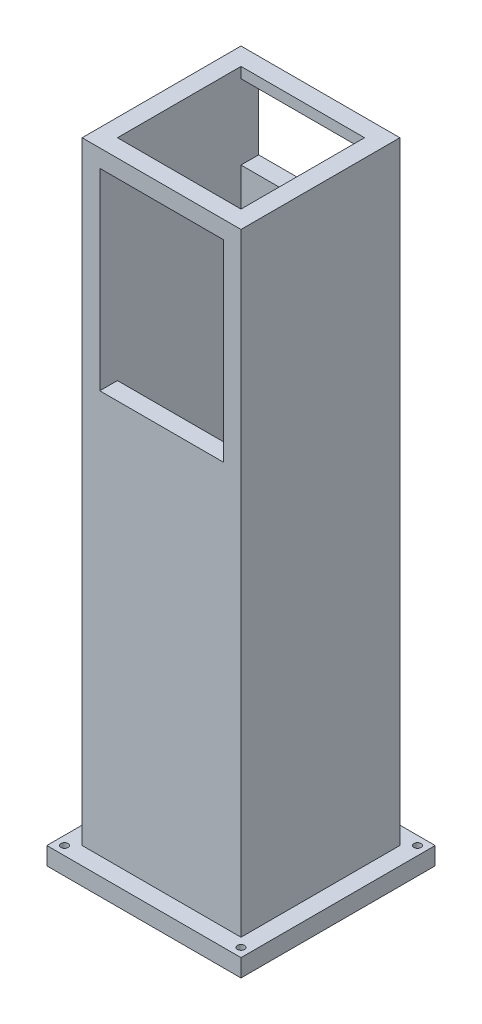
ISO-10303-21;
HEADER;
FILE_DESCRIPTION(('STEP AP214'),'2;1');
FILE_NAME('part.step','',(''),(''),'','','');
FILE_SCHEMA(('AUTOMOTIVE_DESIGN { 1 0 10303 214 1 1 1 1 }'));
ENDSEC;
DATA;
#1=APPLICATION_CONTEXT('core data for automotive mechanical design processes');
#2=APPLICATION_PROTOCOL_DEFINITION('international standard','automotive_design',2000,#1);
#3=PRODUCT_CONTEXT('',#1,'mechanical');
#4=PRODUCT('Part','Part','',(#3));
#5=PRODUCT_RELATED_PRODUCT_CATEGORY('part','',(#4));
#6=PRODUCT_DEFINITION_FORMATION('','',#4);
#7=PRODUCT_DEFINITION_CONTEXT('part definition',#1,'design');
#8=PRODUCT_DEFINITION('design','',#6,#7);
#9=PRODUCT_DEFINITION_SHAPE('','',#8);
#10=(LENGTH_UNIT() NAMED_UNIT(*) SI_UNIT(.MILLI.,.METRE.));
#11=(NAMED_UNIT(*) PLANE_ANGLE_UNIT() SI_UNIT($,.RADIAN.));
#12=(NAMED_UNIT(*) SI_UNIT($,.STERADIAN.) SOLID_ANGLE_UNIT());
#13=UNCERTAINTY_MEASURE_WITH_UNIT(LENGTH_MEASURE(1.E-05),#10,'distance_accuracy_value','');
#14=(GEOMETRIC_REPRESENTATION_CONTEXT(3) GLOBAL_UNCERTAINTY_ASSIGNED_CONTEXT((#13)) GLOBAL_UNIT_ASSIGNED_CONTEXT((#10,
#11,#12)) REPRESENTATION_CONTEXT('',''));
#15=CARTESIAN_POINT('',(0.,0.,0.));
#16=DIRECTION('',(0.,0.,1.));
#17=DIRECTION('',(1.,0.,0.));
#18=AXIS2_PLACEMENT_3D('',#15,#16,#17);
#19=CARTESIAN_POINT('',(-17.5,0.,17.5));
#20=DIRECTION('',(0.,0.,1.));
#21=DIRECTION('',(1.,0.,0.));
#22=AXIS2_PLACEMENT_3D('',#19,#20,#21);
#23=PLANE('',#22);
#24=DIRECTION('',(0.,1.,0.));
#25=VECTOR('',#24,1.);
#26=CARTESIAN_POINT('',(-17.5,0.,17.5));
#27=LINE('',#26,#25);
#28=CARTESIAN_POINT('',(-17.5,268.612120728358,17.5));
#29=VERTEX_POINT('',#28);
#30=CARTESIAN_POINT('',(-17.5,273.612120728358,17.5));
#31=VERTEX_POINT('',#30);
#32=EDGE_CURVE('E332',#29,#31,#27,.T.);
#33=ORIENTED_EDGE('',*,*,#32,.T.);
#34=DIRECTION('',(1.,0.,0.));
#35=VECTOR('',#34,1.);
#36=CARTESIAN_POINT('',(-17.5,273.612120728358,17.5));
#37=LINE('',#36,#35);
#38=CARTESIAN_POINT('',(17.5,273.612120728358,17.5));
#39=VERTEX_POINT('',#38);
#40=EDGE_CURVE('E278',#31,#39,#37,.T.);
#41=ORIENTED_EDGE('',*,*,#40,.T.);
#42=DIRECTION('',(0.,1.,0.));
#43=VECTOR('',#42,1.);
#44=CARTESIAN_POINT('',(17.5,0.,17.5));
#45=LINE('',#44,#43);
#46=CARTESIAN_POINT('',(17.5,268.612120728358,17.5));
#47=VERTEX_POINT('',#46);
#48=EDGE_CURVE('E345',#47,#39,#45,.T.);
#49=ORIENTED_EDGE('',*,*,#48,.F.);
#50=DIRECTION('',(-1.,0.,0.));
#51=VECTOR('',#50,1.);
#52=CARTESIAN_POINT('',(-17.5,268.612120728358,17.5));
#53=LINE('',#52,#51);
#54=EDGE_CURVE('E382',#47,#29,#53,.T.);
#55=ORIENTED_EDGE('',*,*,#54,.T.);
#56=EDGE_LOOP('',(#33,#41,#49,#55));
#57=FACE_BOUND('',#56,.T.);
#58=ADVANCED_FACE('F42',(#57),#23,.F.);
#59=CARTESIAN_POINT('',(-17.5,0.,-17.5));
#60=DIRECTION('',(0.,0.,1.));
#61=DIRECTION('',(1.,0.,0.));
#62=AXIS2_PLACEMENT_3D('',#59,#60,#61);
#63=PLANE('',#62);
#64=DIRECTION('',(1.,0.,0.));
#65=VECTOR('',#64,1.);
#66=CARTESIAN_POINT('',(-17.5,273.612120728358,-17.5));
#67=LINE('',#66,#65);
#68=CARTESIAN_POINT('',(-17.5,273.612120728358,-17.5));
#69=VERTEX_POINT('',#68);
#70=CARTESIAN_POINT('',(17.5,273.612120728358,-17.5));
#71=VERTEX_POINT('',#70);
#72=EDGE_CURVE('E66',#69,#71,#67,.T.);
#73=ORIENTED_EDGE('',*,*,#72,.F.);
#74=DIRECTION('',(0.,1.,0.));
#75=VECTOR('',#74,1.);
#76=CARTESIAN_POINT('',(-17.5,0.,-17.5));
#77=LINE('',#76,#75);
#78=CARTESIAN_POINT('',(-17.5,270.587205010945,-17.5));
#79=VERTEX_POINT('',#78);
#80=EDGE_CURVE('E353',#79,#69,#77,.T.);
#81=ORIENTED_EDGE('',*,*,#80,.F.);
#82=DIRECTION('',(1.,0.,0.));
#83=VECTOR('',#82,1.);
#84=CARTESIAN_POINT('',(-17.5,270.587205010945,-17.5));
#85=LINE('',#84,#83);
#86=CARTESIAN_POINT('',(17.5,270.587205010945,-17.5));
#87=VERTEX_POINT('',#86);
#88=EDGE_CURVE('E371',#79,#87,#85,.T.);
#89=ORIENTED_EDGE('',*,*,#88,.T.);
#90=DIRECTION('',(0.,1.,0.));
#91=VECTOR('',#90,1.);
#92=CARTESIAN_POINT('',(17.5,0.,-17.5));
#93=LINE('',#92,#91);
#94=EDGE_CURVE('E349',#87,#71,#93,.T.);
#95=ORIENTED_EDGE('',*,*,#94,.T.);
#96=EDGE_LOOP('',(#73,#81,#89,#95));
#97=FACE_BOUND('',#96,.T.);
#98=ADVANCED_FACE('F396',(#97),#63,.T.);
#99=CARTESIAN_POINT('',(22.5,300.,22.5));
#100=DIRECTION('',(-1.,0.,0.));
#101=DIRECTION('',(0.,0.,1.));
#102=AXIS2_PLACEMENT_3D('',#99,#100,#101);
#103=PLANE('',#102);
#104=DIRECTION('',(0.,-1.,0.));
#105=VECTOR('',#104,1.);
#106=CARTESIAN_POINT('',(22.5,300.,22.5));
#107=LINE('',#106,#105);
#108=CARTESIAN_POINT('',(22.5,273.612120728358,22.5));
#109=VERTEX_POINT('',#108);
#110=CARTESIAN_POINT('',(22.5,100.,22.5));
#111=VERTEX_POINT('',#110);
#112=EDGE_CURVE('E357',#109,#111,#107,.T.);
#113=ORIENTED_EDGE('',*,*,#112,.T.);
#114=DIRECTION('',(0.,0.,1.));
#115=VECTOR('',#114,1.);
#116=CARTESIAN_POINT('',(22.5,100.,22.5));
#117=LINE('',#116,#115);
#118=CARTESIAN_POINT('',(22.5,100.,-22.5));
#119=VERTEX_POINT('',#118);
#120=EDGE_CURVE('E231',#119,#111,#117,.T.);
#121=ORIENTED_EDGE('',*,*,#120,.F.);
#122=DIRECTION('',(0.,-1.,0.));
#123=VECTOR('',#122,1.);
#124=CARTESIAN_POINT('',(22.5,300.,-22.5));
#125=LINE('',#124,#123);
#126=CARTESIAN_POINT('',(22.5,273.612120728358,-22.5));
#127=VERTEX_POINT('',#126);
#128=EDGE_CURVE('E367',#127,#119,#125,.T.);
#129=ORIENTED_EDGE('',*,*,#128,.F.);
#130=DIRECTION('',(0.,0.,1.));
#131=VECTOR('',#130,1.);
#132=CARTESIAN_POINT('',(22.5,273.612120728358,-22.5));
#133=LINE('',#132,#131);
#134=EDGE_CURVE('E270',#127,#109,#133,.T.);
#135=ORIENTED_EDGE('',*,*,#134,.T.);
#136=EDGE_LOOP('',(#113,#121,#129,#135));
#137=FACE_BOUND('',#136,.T.);
#138=ADVANCED_FACE('F44',(#137),#103,.F.);
#139=CARTESIAN_POINT('',(-22.5,300.,-22.5));
#140=DIRECTION('',(0.,0.,1.));
#141=DIRECTION('',(1.,0.,0.));
#142=AXIS2_PLACEMENT_3D('',#139,#140,#141);
#143=PLANE('',#142);
#144=DIRECTION('',(0.,1.,0.));
#145=VECTOR('',#144,1.);
#146=CARTESIAN_POINT('',(-17.5,249.412794989055,-22.5));
#147=LINE('',#146,#145);
#148=CARTESIAN_POINT('',(-17.5,249.412794989055,-22.5));
#149=VERTEX_POINT('',#148);
#150=CARTESIAN_POINT('',(-17.5,270.587205010945,-22.5));
#151=VERTEX_POINT('',#150);
#152=EDGE_CURVE('E316',#149,#151,#147,.T.);
#153=ORIENTED_EDGE('',*,*,#152,.F.);
#154=DIRECTION('',(-1.,0.,0.));
#155=VECTOR('',#154,1.);
#156=CARTESIAN_POINT('',(17.5,249.412794989055,-22.5));
#157=LINE('',#156,#155);
#158=CARTESIAN_POINT('',(17.5,249.412794989055,-22.5));
#159=VERTEX_POINT('',#158);
#160=EDGE_CURVE('E304',#159,#149,#157,.T.);
#161=ORIENTED_EDGE('',*,*,#160,.F.);
#162=DIRECTION('',(0.,1.,0.));
#163=VECTOR('',#162,1.);
#164=CARTESIAN_POINT('',(17.5,249.412794989055,-22.5));
#165=LINE('',#164,#163);
#166=CARTESIAN_POINT('',(17.5,270.587205010945,-22.5));
#167=VERTEX_POINT('',#166);
#168=EDGE_CURVE('E324',#159,#167,#165,.T.);
#169=ORIENTED_EDGE('',*,*,#168,.T.);
#170=DIRECTION('',(-1.,0.,0.));
#171=VECTOR('',#170,1.);
#172=CARTESIAN_POINT('',(17.5,270.587205010945,-22.5));
#173=LINE('',#172,#171);
#174=EDGE_CURVE('E320',#167,#151,#173,.T.);
#175=ORIENTED_EDGE('',*,*,#174,.T.);
#176=EDGE_LOOP('',(#153,#161,#169,#175));
#177=FACE_BOUND('',#176,.T.);
#178=ORIENTED_EDGE('',*,*,#128,.T.);
#179=DIRECTION('',(1.,0.,0.));
#180=VECTOR('',#179,1.);
#181=CARTESIAN_POINT('',(-22.5,100.,-22.5));
#182=LINE('',#181,#180);
#183=CARTESIAN_POINT('',(-22.5,100.,-22.5));
#184=VERTEX_POINT('',#183);
#185=EDGE_CURVE('E244',#184,#119,#182,.T.);
#186=ORIENTED_EDGE('',*,*,#185,.F.);
#187=DIRECTION('',(0.,-1.,0.));
#188=VECTOR('',#187,1.);
#189=CARTESIAN_POINT('',(-22.5,300.,-22.5));
#190=LINE('',#189,#188);
#191=CARTESIAN_POINT('',(-22.5,273.612120728358,-22.5));
#192=VERTEX_POINT('',#191);
#193=EDGE_CURVE('E364',#192,#184,#190,.T.);
#194=ORIENTED_EDGE('',*,*,#193,.F.);
#195=DIRECTION('',(1.,0.,0.));
#196=VECTOR('',#195,1.);
#197=CARTESIAN_POINT('',(-22.5,273.612120728358,-22.5));
#198=LINE('',#197,#196);
#199=EDGE_CURVE('E264',#192,#127,#198,.T.);
#200=ORIENTED_EDGE('',*,*,#199,.T.);
#201=EDGE_LOOP('',(#178,#186,#194,#200));
#202=FACE_BOUND('',#201,.T.);
#203=ADVANCED_FACE('F446',(#177,#202),#143,.F.);
#204=CARTESIAN_POINT('',(-22.5,300.,22.5));
#205=DIRECTION('',(1.,0.,0.));
#206=DIRECTION('',(0.,0.,-1.));
#207=AXIS2_PLACEMENT_3D('',#204,#205,#206);
#208=PLANE('',#207);
#209=ORIENTED_EDGE('',*,*,#193,.T.);
#210=DIRECTION('',(0.,0.,1.));
#211=VECTOR('',#210,1.);
#212=CARTESIAN_POINT('',(-22.5,100.,22.5));
#213=LINE('',#212,#211);
#214=CARTESIAN_POINT('',(-22.5,100.,22.5));
#215=VERTEX_POINT('',#214);
#216=EDGE_CURVE('E241',#184,#215,#213,.T.);
#217=ORIENTED_EDGE('',*,*,#216,.T.);
#218=DIRECTION('',(0.,-1.,0.));
#219=VECTOR('',#218,1.);
#220=CARTESIAN_POINT('',(-22.5,300.,22.5));
#221=LINE('',#220,#219);
#222=CARTESIAN_POINT('',(-22.5,273.612120728358,22.5));
#223=VERTEX_POINT('',#222);
#224=EDGE_CURVE('E360',#223,#215,#221,.T.);
#225=ORIENTED_EDGE('',*,*,#224,.F.);
#226=DIRECTION('',(0.,0.,1.));
#227=VECTOR('',#226,1.);
#228=CARTESIAN_POINT('',(-22.5,273.612120728358,-22.5));
#229=LINE('',#228,#227);
#230=EDGE_CURVE('E58',#192,#223,#229,.T.);
#231=ORIENTED_EDGE('',*,*,#230,.F.);
#232=EDGE_LOOP('',(#209,#217,#225,#231));
#233=FACE_BOUND('',#232,.T.);
#234=ADVANCED_FACE('F489',(#233),#208,.F.);
#235=CARTESIAN_POINT('',(-22.5,300.,22.5));
#236=DIRECTION('',(0.,0.,-1.));
#237=DIRECTION('',(-1.,0.,0.));
#238=AXIS2_PLACEMENT_3D('',#235,#236,#237);
#239=PLANE('',#238);
#240=DIRECTION('',(1.,0.,0.));
#241=VECTOR('',#240,1.);
#242=CARTESIAN_POINT('',(-17.5,214.038722741917,22.5));
#243=LINE('',#242,#241);
#244=CARTESIAN_POINT('',(-17.5,214.038722741917,22.5));
#245=VERTEX_POINT('',#244);
#246=CARTESIAN_POINT('',(17.5,214.038722741917,22.5));
#247=VERTEX_POINT('',#246);
#248=EDGE_CURVE('E288',#245,#247,#243,.T.);
#249=ORIENTED_EDGE('',*,*,#248,.F.);
#250=DIRECTION('',(0.,-1.,0.));
#251=VECTOR('',#250,1.);
#252=CARTESIAN_POINT('',(-17.5,268.612120728358,22.5));
#253=LINE('',#252,#251);
#254=CARTESIAN_POINT('',(-17.5,268.612120728358,22.5));
#255=VERTEX_POINT('',#254);
#256=EDGE_CURVE('E285',#255,#245,#253,.T.);
#257=ORIENTED_EDGE('',*,*,#256,.F.);
#258=DIRECTION('',(-1.,0.,0.));
#259=VECTOR('',#258,1.);
#260=CARTESIAN_POINT('',(-17.5,268.612120728358,22.5));
#261=LINE('',#260,#259);
#262=CARTESIAN_POINT('',(17.5,268.612120728358,22.5));
#263=VERTEX_POINT('',#262);
#264=EDGE_CURVE('E296',#263,#255,#261,.T.);
#265=ORIENTED_EDGE('',*,*,#264,.F.);
#266=DIRECTION('',(0.,1.,0.));
#267=VECTOR('',#266,1.);
#268=CARTESIAN_POINT('',(17.5,268.612120728358,22.5));
#269=LINE('',#268,#267);
#270=EDGE_CURVE('E292',#247,#263,#269,.T.);
#271=ORIENTED_EDGE('',*,*,#270,.F.);
#272=EDGE_LOOP('',(#249,#257,#265,#271));
#273=FACE_BOUND('',#272,.T.);
#274=ORIENTED_EDGE('',*,*,#224,.T.);
#275=DIRECTION('',(1.,0.,0.));
#276=VECTOR('',#275,1.);
#277=CARTESIAN_POINT('',(-22.5,100.,22.5));
#278=LINE('',#277,#276);
#279=EDGE_CURVE('E245',#215,#111,#278,.T.);
#280=ORIENTED_EDGE('',*,*,#279,.T.);
#281=ORIENTED_EDGE('',*,*,#112,.F.);
#282=DIRECTION('',(1.,0.,0.));
#283=VECTOR('',#282,1.);
#284=CARTESIAN_POINT('',(-22.5,273.612120728358,22.5));
#285=LINE('',#284,#283);
#286=EDGE_CURVE('E263',#223,#109,#285,.T.);
#287=ORIENTED_EDGE('',*,*,#286,.F.);
#288=EDGE_LOOP('',(#274,#280,#281,#287));
#289=FACE_BOUND('',#288,.T.);
#290=ADVANCED_FACE('F470',(#273,#289),#239,.F.);
#291=CARTESIAN_POINT('',(-17.5,0.,17.5));
#292=DIRECTION('',(1.,0.,0.));
#293=DIRECTION('',(0.,0.,-1.));
#294=AXIS2_PLACEMENT_3D('',#291,#292,#293);
#295=PLANE('',#294);
#296=DIRECTION('',(0.,0.,1.));
#297=VECTOR('',#296,1.);
#298=CARTESIAN_POINT('',(-17.5,100.,17.5));
#299=LINE('',#298,#297);
#300=CARTESIAN_POINT('',(-17.5,100.,-17.5));
#301=VERTEX_POINT('',#300);
#302=CARTESIAN_POINT('',(-17.5,100.,17.5));
#303=VERTEX_POINT('',#302);
#304=EDGE_CURVE('E256',#301,#303,#299,.T.);
#305=ORIENTED_EDGE('',*,*,#304,.F.);
#306=CARTESIAN_POINT('',(-17.5,249.412794989055,-17.5));
#307=VERTEX_POINT('',#306);
#308=EDGE_CURVE('E354',#301,#307,#77,.T.);
#309=ORIENTED_EDGE('',*,*,#308,.T.);
#310=DIRECTION('',(0.,0.,-1.));
#311=VECTOR('',#310,1.);
#312=CARTESIAN_POINT('',(-17.5,249.412794989055,-12.5));
#313=LINE('',#312,#311);
#314=EDGE_CURVE('E328',#307,#149,#313,.T.);
#315=ORIENTED_EDGE('',*,*,#314,.T.);
#316=ORIENTED_EDGE('',*,*,#152,.T.);
#317=DIRECTION('',(0.,0.,-1.));
#318=VECTOR('',#317,1.);
#319=CARTESIAN_POINT('',(-17.5,270.587205010945,-12.5));
#320=LINE('',#319,#318);
#321=EDGE_CURVE('E336',#79,#151,#320,.T.);
#322=ORIENTED_EDGE('',*,*,#321,.F.);
#323=ORIENTED_EDGE('',*,*,#80,.T.);
#324=DIRECTION('',(0.,0.,-1.));
#325=VECTOR('',#324,1.);
#326=CARTESIAN_POINT('',(-17.5,273.612120728358,17.5));
#327=LINE('',#326,#325);
#328=EDGE_CURVE('E282',#31,#69,#327,.T.);
#329=ORIENTED_EDGE('',*,*,#328,.F.);
#330=ORIENTED_EDGE('',*,*,#32,.F.);
#331=DIRECTION('',(0.,0.,1.));
#332=VECTOR('',#331,1.);
#333=CARTESIAN_POINT('',(-17.5,268.612120728358,12.5));
#334=LINE('',#333,#332);
#335=EDGE_CURVE('E301',#29,#255,#334,.T.);
#336=ORIENTED_EDGE('',*,*,#335,.T.);
#337=ORIENTED_EDGE('',*,*,#256,.T.);
#338=DIRECTION('',(0.,0.,1.));
#339=VECTOR('',#338,1.);
#340=CARTESIAN_POINT('',(-17.5,214.038722741917,12.5));
#341=LINE('',#340,#339);
#342=CARTESIAN_POINT('',(-17.5,214.038722741917,17.5));
#343=VERTEX_POINT('',#342);
#344=EDGE_CURVE('E300',#343,#245,#341,.T.);
#345=ORIENTED_EDGE('',*,*,#344,.F.);
#346=EDGE_CURVE('E342',#303,#343,#27,.T.);
#347=ORIENTED_EDGE('',*,*,#346,.F.);
#348=EDGE_LOOP('',(#305,#309,#315,#316,#322,#323,#329,#330,#336,#337,#345,#347));
#349=FACE_BOUND('',#348,.T.);
#350=ADVANCED_FACE('F436',(#349),#295,.T.);
#351=CARTESIAN_POINT('',(17.5,0.,17.5));
#352=DIRECTION('',(1.,0.,0.));
#353=DIRECTION('',(0.,0.,-1.));
#354=AXIS2_PLACEMENT_3D('',#351,#352,#353);
#355=PLANE('',#354);
#356=CARTESIAN_POINT('',(17.5,100.,-17.5));
#357=VERTEX_POINT('',#356);
#358=CARTESIAN_POINT('',(17.5,249.412794989055,-17.5));
#359=VERTEX_POINT('',#358);
#360=EDGE_CURVE('E350',#357,#359,#93,.T.);
#361=ORIENTED_EDGE('',*,*,#360,.F.);
#362=DIRECTION('',(0.,0.,1.));
#363=VECTOR('',#362,1.);
#364=CARTESIAN_POINT('',(17.5,100.,17.5));
#365=LINE('',#364,#363);
#366=CARTESIAN_POINT('',(17.5,100.,17.5));
#367=VERTEX_POINT('',#366);
#368=EDGE_CURVE('E249',#357,#367,#365,.T.);
#369=ORIENTED_EDGE('',*,*,#368,.T.);
#370=CARTESIAN_POINT('',(17.5,214.038722741917,17.5));
#371=VERTEX_POINT('',#370);
#372=EDGE_CURVE('E346',#367,#371,#45,.T.);
#373=ORIENTED_EDGE('',*,*,#372,.T.);
#374=DIRECTION('',(0.,0.,1.));
#375=VECTOR('',#374,1.);
#376=CARTESIAN_POINT('',(17.5,214.038722741917,12.5));
#377=LINE('',#376,#375);
#378=EDGE_CURVE('E308',#371,#247,#377,.T.);
#379=ORIENTED_EDGE('',*,*,#378,.T.);
#380=ORIENTED_EDGE('',*,*,#270,.T.);
#381=DIRECTION('',(0.,0.,1.));
#382=VECTOR('',#381,1.);
#383=CARTESIAN_POINT('',(17.5,268.612120728358,12.5));
#384=LINE('',#383,#382);
#385=EDGE_CURVE('E305',#47,#263,#384,.T.);
#386=ORIENTED_EDGE('',*,*,#385,.F.);
#387=ORIENTED_EDGE('',*,*,#48,.T.);
#388=DIRECTION('',(0.,0.,-1.));
#389=VECTOR('',#388,1.);
#390=CARTESIAN_POINT('',(17.5,273.612120728358,17.5));
#391=LINE('',#390,#389);
#392=EDGE_CURVE('E51',#39,#71,#391,.T.);
#393=ORIENTED_EDGE('',*,*,#392,.T.);
#394=ORIENTED_EDGE('',*,*,#94,.F.);
#395=DIRECTION('',(0.,0.,-1.));
#396=VECTOR('',#395,1.);
#397=CARTESIAN_POINT('',(17.5,270.587205010945,-12.5));
#398=LINE('',#397,#396);
#399=EDGE_CURVE('E333',#87,#167,#398,.T.);
#400=ORIENTED_EDGE('',*,*,#399,.T.);
#401=ORIENTED_EDGE('',*,*,#168,.F.);
#402=DIRECTION('',(0.,0.,-1.));
#403=VECTOR('',#402,1.);
#404=CARTESIAN_POINT('',(17.5,249.412794989055,-12.5));
#405=LINE('',#404,#403);
#406=EDGE_CURVE('E329',#359,#159,#405,.T.);
#407=ORIENTED_EDGE('',*,*,#406,.F.);
#408=EDGE_LOOP('',(#361,#369,#373,#379,#380,#386,#387,#393,#394,#400,#401,#407));
#409=FACE_BOUND('',#408,.T.);
#410=ADVANCED_FACE('F392',(#409),#355,.F.);
#411=ORIENTED_EDGE('',*,*,#372,.F.);
#412=DIRECTION('',(-1.,0.,0.));
#413=VECTOR('',#412,1.);
#414=CARTESIAN_POINT('',(-17.5,100.,17.5));
#415=LINE('',#414,#413);
#416=EDGE_CURVE('E259',#367,#303,#415,.T.);
#417=ORIENTED_EDGE('',*,*,#416,.T.);
#418=ORIENTED_EDGE('',*,*,#346,.T.);
#419=DIRECTION('',(1.,0.,0.));
#420=VECTOR('',#419,1.);
#421=CARTESIAN_POINT('',(-17.5,214.038722741917,17.5));
#422=LINE('',#421,#420);
#423=EDGE_CURVE('E378',#343,#371,#422,.T.);
#424=ORIENTED_EDGE('',*,*,#423,.T.);
#425=EDGE_LOOP('',(#411,#417,#418,#424));
#426=FACE_BOUND('',#425,.T.);
#427=ADVANCED_FACE('F461',(#426),#23,.F.);
#428=DIRECTION('',(-1.,0.,0.));
#429=VECTOR('',#428,1.);
#430=CARTESIAN_POINT('',(-17.5,100.,-17.5));
#431=LINE('',#430,#429);
#432=EDGE_CURVE('E11',#357,#301,#431,.T.);
#433=ORIENTED_EDGE('',*,*,#432,.F.);
#434=ORIENTED_EDGE('',*,*,#360,.T.);
#435=DIRECTION('',(1.,0.,0.));
#436=VECTOR('',#435,1.);
#437=CARTESIAN_POINT('',(-17.5,249.412794989055,-17.5));
#438=LINE('',#437,#436);
#439=EDGE_CURVE('E375',#307,#359,#438,.T.);
#440=ORIENTED_EDGE('',*,*,#439,.F.);
#441=ORIENTED_EDGE('',*,*,#308,.F.);
#442=EDGE_LOOP('',(#433,#434,#440,#441));
#443=FACE_BOUND('',#442,.T.);
#444=ADVANCED_FACE('F456',(#443),#63,.T.);
#445=CARTESIAN_POINT('',(17.5,249.412794989055,-12.5));
#446=DIRECTION('',(0.,-1.,0.));
#447=DIRECTION('',(0.,0.,-1.));
#448=AXIS2_PLACEMENT_3D('',#445,#446,#447);
#449=PLANE('',#448);
#450=ORIENTED_EDGE('',*,*,#439,.T.);
#451=ORIENTED_EDGE('',*,*,#406,.T.);
#452=ORIENTED_EDGE('',*,*,#160,.T.);
#453=ORIENTED_EDGE('',*,*,#314,.F.);
#454=EDGE_LOOP('',(#450,#451,#452,#453));
#455=FACE_BOUND('',#454,.T.);
#456=ADVANCED_FACE('F450',(#455),#449,.F.);
#457=CARTESIAN_POINT('',(17.5,270.587205010945,-12.5));
#458=DIRECTION('',(0.,-1.,0.));
#459=DIRECTION('',(0.,0.,-1.));
#460=AXIS2_PLACEMENT_3D('',#457,#458,#459);
#461=PLANE('',#460);
#462=ORIENTED_EDGE('',*,*,#321,.T.);
#463=ORIENTED_EDGE('',*,*,#174,.F.);
#464=ORIENTED_EDGE('',*,*,#399,.F.);
#465=ORIENTED_EDGE('',*,*,#88,.F.);
#466=EDGE_LOOP('',(#462,#463,#464,#465));
#467=FACE_BOUND('',#466,.T.);
#468=ADVANCED_FACE('F441',(#467),#461,.T.);
#469=CARTESIAN_POINT('',(-17.5,268.612120728358,12.5));
#470=DIRECTION('',(0.,1.,0.));
#471=DIRECTION('',(0.,0.,1.));
#472=AXIS2_PLACEMENT_3D('',#469,#470,#471);
#473=PLANE('',#472);
#474=ORIENTED_EDGE('',*,*,#385,.T.);
#475=ORIENTED_EDGE('',*,*,#264,.T.);
#476=ORIENTED_EDGE('',*,*,#335,.F.);
#477=ORIENTED_EDGE('',*,*,#54,.F.);
#478=EDGE_LOOP('',(#474,#475,#476,#477));
#479=FACE_BOUND('',#478,.T.);
#480=ADVANCED_FACE('F555',(#479),#473,.F.);
#481=CARTESIAN_POINT('',(-17.5,214.038722741917,12.5));
#482=DIRECTION('',(0.,-1.,0.));
#483=DIRECTION('',(0.,0.,-1.));
#484=AXIS2_PLACEMENT_3D('',#481,#482,#483);
#485=PLANE('',#484);
#486=ORIENTED_EDGE('',*,*,#344,.T.);
#487=ORIENTED_EDGE('',*,*,#248,.T.);
#488=ORIENTED_EDGE('',*,*,#378,.F.);
#489=ORIENTED_EDGE('',*,*,#423,.F.);
#490=EDGE_LOOP('',(#486,#487,#488,#489));
#491=FACE_BOUND('',#490,.T.);
#492=ADVANCED_FACE('F465',(#491),#485,.F.);
#493=CARTESIAN_POINT('',(-22.5,273.612120728358,-22.5));
#494=DIRECTION('',(0.,-1.,0.));
#495=DIRECTION('',(0.,0.,-1.));
#496=AXIS2_PLACEMENT_3D('',#493,#494,#495);
#497=PLANE('',#496);
#498=ORIENTED_EDGE('',*,*,#328,.T.);
#499=ORIENTED_EDGE('',*,*,#72,.T.);
#500=ORIENTED_EDGE('',*,*,#392,.F.);
#501=ORIENTED_EDGE('',*,*,#40,.F.);
#502=EDGE_LOOP('',(#498,#499,#500,#501));
#503=FACE_BOUND('',#502,.T.);
#504=ORIENTED_EDGE('',*,*,#286,.T.);
#505=ORIENTED_EDGE('',*,*,#134,.F.);
#506=ORIENTED_EDGE('',*,*,#199,.F.);
#507=ORIENTED_EDGE('',*,*,#230,.T.);
#508=EDGE_LOOP('',(#504,#505,#506,#507));
#509=FACE_BOUND('',#508,.T.);
#510=ADVANCED_FACE('F475',(#503,#509),#497,.F.);
#511=CARTESIAN_POINT('',(0.,100.,0.));
#512=DIRECTION('',(0.,1.,0.));
#513=DIRECTION('',(0.,0.,1.));
#514=AXIS2_PLACEMENT_3D('',#511,#512,#513);
#515=PLANE('',#514);
#516=ORIENTED_EDGE('',*,*,#368,.F.);
#517=ORIENTED_EDGE('',*,*,#432,.T.);
#518=ORIENTED_EDGE('',*,*,#304,.T.);
#519=ORIENTED_EDGE('',*,*,#416,.F.);
#520=EDGE_LOOP('',(#516,#517,#518,#519));
#521=FACE_BOUND('',#520,.T.);
#522=ADVANCED_FACE('F477',(#521),#515,.T.);
#523=CARTESIAN_POINT('',(25.,100.,-25.));
#524=DIRECTION('',(0.,1.,0.));
#525=DIRECTION('',(0.,0.,1.));
#526=AXIS2_PLACEMENT_3D('',#523,#524,#525);
#527=CIRCLE('',#526,1.);
#528=CARTESIAN_POINT('',(25.,100.,-24.));
#529=VERTEX_POINT('',#528);
#530=EDGE_CURVE('E214',#529,#529,#527,.T.);
#531=ORIENTED_EDGE('',*,*,#530,.F.);
#532=EDGE_LOOP('',(#531));
#533=FACE_BOUND('',#532,.T.);
#534=CARTESIAN_POINT('',(-25.,100.,-25.));
#535=DIRECTION('',(0.,1.,0.));
#536=DIRECTION('',(0.,0.,1.));
#537=AXIS2_PLACEMENT_3D('',#534,#535,#536);
#538=CIRCLE('',#537,1.);
#539=CARTESIAN_POINT('',(-25.,100.,-24.));
#540=VERTEX_POINT('',#539);
#541=EDGE_CURVE('E404',#540,#540,#538,.T.);
#542=ORIENTED_EDGE('',*,*,#541,.F.);
#543=EDGE_LOOP('',(#542));
#544=FACE_BOUND('',#543,.T.);
#545=CARTESIAN_POINT('',(-25.,100.,25.));
#546=DIRECTION('',(0.,1.,0.));
#547=DIRECTION('',(0.,0.,1.));
#548=AXIS2_PLACEMENT_3D('',#545,#546,#547);
#549=CIRCLE('',#548,1.);
#550=CARTESIAN_POINT('',(-25.,100.,26.));
#551=VERTEX_POINT('',#550);
#552=EDGE_CURVE('E402',#551,#551,#549,.T.);
#553=ORIENTED_EDGE('',*,*,#552,.F.);
#554=EDGE_LOOP('',(#553));
#555=FACE_BOUND('',#554,.T.);
#556=CARTESIAN_POINT('',(25.,100.,25.));
#557=DIRECTION('',(0.,1.,0.));
#558=DIRECTION('',(0.,0.,1.));
#559=AXIS2_PLACEMENT_3D('',#556,#557,#558);
#560=CIRCLE('',#559,1.);
#561=CARTESIAN_POINT('',(25.,100.,26.));
#562=VERTEX_POINT('',#561);
#563=EDGE_CURVE('E405',#562,#562,#560,.T.);
#564=ORIENTED_EDGE('',*,*,#563,.F.);
#565=EDGE_LOOP('',(#564));
#566=FACE_BOUND('',#565,.T.);
#567=DIRECTION('',(0.,0.,1.));
#568=VECTOR('',#567,1.);
#569=CARTESIAN_POINT('',(-27.5,100.,-27.5));
#570=LINE('',#569,#568);
#571=CARTESIAN_POINT('',(-27.5,100.,-27.5));
#572=VERTEX_POINT('',#571);
#573=CARTESIAN_POINT('',(-27.5,100.,27.5));
#574=VERTEX_POINT('',#573);
#575=EDGE_CURVE('E221',#572,#574,#570,.T.);
#576=ORIENTED_EDGE('',*,*,#575,.T.);
#577=DIRECTION('',(1.,0.,0.));
#578=VECTOR('',#577,1.);
#579=CARTESIAN_POINT('',(-27.5,100.,27.5));
#580=LINE('',#579,#578);
#581=CARTESIAN_POINT('',(27.5,100.,27.5));
#582=VERTEX_POINT('',#581);
#583=EDGE_CURVE('E184',#574,#582,#580,.T.);
#584=ORIENTED_EDGE('',*,*,#583,.T.);
#585=DIRECTION('',(0.,0.,1.));
#586=VECTOR('',#585,1.);
#587=CARTESIAN_POINT('',(27.5,100.,-27.5));
#588=LINE('',#587,#586);
#589=CARTESIAN_POINT('',(27.5,100.,-27.5));
#590=VERTEX_POINT('',#589);
#591=EDGE_CURVE('E211',#590,#582,#588,.T.);
#592=ORIENTED_EDGE('',*,*,#591,.F.);
#593=DIRECTION('',(1.,0.,0.));
#594=VECTOR('',#593,1.);
#595=CARTESIAN_POINT('',(-27.5,100.,-27.5));
#596=LINE('',#595,#594);
#597=EDGE_CURVE('E206',#572,#590,#596,.T.);
#598=ORIENTED_EDGE('',*,*,#597,.F.);
#599=EDGE_LOOP('',(#576,#584,#592,#598));
#600=FACE_BOUND('',#599,.T.);
#601=ORIENTED_EDGE('',*,*,#279,.F.);
#602=ORIENTED_EDGE('',*,*,#216,.F.);
#603=ORIENTED_EDGE('',*,*,#185,.T.);
#604=ORIENTED_EDGE('',*,*,#120,.T.);
#605=EDGE_LOOP('',(#601,#602,#603,#604));
#606=FACE_BOUND('',#605,.T.);
#607=ADVANCED_FACE('F486',(#533,#544,#555,#566,#600,#606),#515,.T.);
#608=CARTESIAN_POINT('',(-27.5,95.,-27.5));
#609=DIRECTION('',(-1.,0.,0.));
#610=DIRECTION('',(0.,0.,1.));
#611=AXIS2_PLACEMENT_3D('',#608,#609,#610);
#612=PLANE('',#611);
#613=ORIENTED_EDGE('',*,*,#575,.F.);
#614=DIRECTION('',(0.,1.,0.));
#615=VECTOR('',#614,1.);
#616=CARTESIAN_POINT('',(-27.5,95.,-27.5));
#617=LINE('',#616,#615);
#618=CARTESIAN_POINT('',(-27.5,95.,-27.5));
#619=VERTEX_POINT('',#618);
#620=EDGE_CURVE('E203',#619,#572,#617,.T.);
#621=ORIENTED_EDGE('',*,*,#620,.F.);
#622=DIRECTION('',(0.,0.,1.));
#623=VECTOR('',#622,1.);
#624=CARTESIAN_POINT('',(-27.5,95.,-27.5));
#625=LINE('',#624,#623);
#626=CARTESIAN_POINT('',(-27.5,95.,27.5));
#627=VERTEX_POINT('',#626);
#628=EDGE_CURVE('E196',#619,#627,#625,.T.);
#629=ORIENTED_EDGE('',*,*,#628,.T.);
#630=DIRECTION('',(0.,1.,0.));
#631=VECTOR('',#630,1.);
#632=CARTESIAN_POINT('',(-27.5,95.,27.5));
#633=LINE('',#632,#631);
#634=EDGE_CURVE('E179',#627,#574,#633,.T.);
#635=ORIENTED_EDGE('',*,*,#634,.T.);
#636=EDGE_LOOP('',(#613,#621,#629,#635));
#637=FACE_BOUND('',#636,.T.);
#638=ADVANCED_FACE('F202',(#637),#612,.T.);
#639=CARTESIAN_POINT('',(-27.5,95.,-27.5));
#640=DIRECTION('',(0.,0.,1.));
#641=DIRECTION('',(1.,0.,0.));
#642=AXIS2_PLACEMENT_3D('',#639,#640,#641);
#643=PLANE('',#642);
#644=ORIENTED_EDGE('',*,*,#597,.T.);
#645=DIRECTION('',(0.,1.,0.));
#646=VECTOR('',#645,1.);
#647=CARTESIAN_POINT('',(27.5,95.,-27.5));
#648=LINE('',#647,#646);
#649=CARTESIAN_POINT('',(27.5,95.,-27.5));
#650=VERTEX_POINT('',#649);
#651=EDGE_CURVE('E232',#650,#590,#648,.T.);
#652=ORIENTED_EDGE('',*,*,#651,.F.);
#653=DIRECTION('',(1.,0.,0.));
#654=VECTOR('',#653,1.);
#655=CARTESIAN_POINT('',(-27.5,95.,-27.5));
#656=LINE('',#655,#654);
#657=EDGE_CURVE('E191',#619,#650,#656,.T.);
#658=ORIENTED_EDGE('',*,*,#657,.F.);
#659=ORIENTED_EDGE('',*,*,#620,.T.);
#660=EDGE_LOOP('',(#644,#652,#658,#659));
#661=FACE_BOUND('',#660,.T.);
#662=ADVANCED_FACE('F668',(#661),#643,.F.);
#663=CARTESIAN_POINT('',(27.5,95.,-27.5));
#664=DIRECTION('',(-1.,0.,0.));
#665=DIRECTION('',(0.,0.,1.));
#666=AXIS2_PLACEMENT_3D('',#663,#664,#665);
#667=PLANE('',#666);
#668=ORIENTED_EDGE('',*,*,#591,.T.);
#669=DIRECTION('',(0.,1.,0.));
#670=VECTOR('',#669,1.);
#671=CARTESIAN_POINT('',(27.5,95.,27.5));
#672=LINE('',#671,#670);
#673=CARTESIAN_POINT('',(27.5,95.,27.5));
#674=VERTEX_POINT('',#673);
#675=EDGE_CURVE('E190',#674,#582,#672,.T.);
#676=ORIENTED_EDGE('',*,*,#675,.F.);
#677=DIRECTION('',(0.,0.,1.));
#678=VECTOR('',#677,1.);
#679=CARTESIAN_POINT('',(27.5,95.,-27.5));
#680=LINE('',#679,#678);
#681=EDGE_CURVE('E198',#650,#674,#680,.T.);
#682=ORIENTED_EDGE('',*,*,#681,.F.);
#683=ORIENTED_EDGE('',*,*,#651,.T.);
#684=EDGE_LOOP('',(#668,#676,#682,#683));
#685=FACE_BOUND('',#684,.T.);
#686=ADVANCED_FACE('F678',(#685),#667,.F.);
#687=CARTESIAN_POINT('',(-27.5,95.,27.5));
#688=DIRECTION('',(0.,0.,1.));
#689=DIRECTION('',(1.,0.,0.));
#690=AXIS2_PLACEMENT_3D('',#687,#688,#689);
#691=PLANE('',#690);
#692=ORIENTED_EDGE('',*,*,#583,.F.);
#693=ORIENTED_EDGE('',*,*,#634,.F.);
#694=DIRECTION('',(1.,0.,0.));
#695=VECTOR('',#694,1.);
#696=CARTESIAN_POINT('',(-27.5,95.,27.5));
#697=LINE('',#696,#695);
#698=EDGE_CURVE('E182',#627,#674,#697,.T.);
#699=ORIENTED_EDGE('',*,*,#698,.T.);
#700=ORIENTED_EDGE('',*,*,#675,.T.);
#701=EDGE_LOOP('',(#692,#693,#699,#700));
#702=FACE_BOUND('',#701,.T.);
#703=ADVANCED_FACE('F181',(#702),#691,.T.);
#704=CARTESIAN_POINT('',(0.,95.,0.));
#705=DIRECTION('',(0.,1.,0.));
#706=DIRECTION('',(0.,0.,1.));
#707=AXIS2_PLACEMENT_3D('',#704,#705,#706);
#708=PLANE('',#707);
#709=CARTESIAN_POINT('',(25.,95.,-25.));
#710=DIRECTION('',(0.,-1.,0.));
#711=DIRECTION('',(0.,0.,-1.));
#712=AXIS2_PLACEMENT_3D('',#709,#710,#711);
#713=CIRCLE('',#712,1.);
#714=CARTESIAN_POINT('',(25.,95.,-26.));
#715=VERTEX_POINT('',#714);
#716=EDGE_CURVE('E413',#715,#715,#713,.T.);
#717=ORIENTED_EDGE('',*,*,#716,.F.);
#718=EDGE_LOOP('',(#717));
#719=FACE_BOUND('',#718,.T.);
#720=CARTESIAN_POINT('',(-25.,95.,-25.));
#721=DIRECTION('',(0.,-1.,0.));
#722=DIRECTION('',(0.,0.,-1.));
#723=AXIS2_PLACEMENT_3D('',#720,#721,#722);
#724=CIRCLE('',#723,1.);
#725=CARTESIAN_POINT('',(-25.,95.,-26.));
#726=VERTEX_POINT('',#725);
#727=EDGE_CURVE('E410',#726,#726,#724,.T.);
#728=ORIENTED_EDGE('',*,*,#727,.F.);
#729=EDGE_LOOP('',(#728));
#730=FACE_BOUND('',#729,.T.);
#731=CARTESIAN_POINT('',(-25.,95.,25.));
#732=DIRECTION('',(0.,-1.,0.));
#733=DIRECTION('',(0.,0.,-1.));
#734=AXIS2_PLACEMENT_3D('',#731,#732,#733);
#735=CIRCLE('',#734,1.);
#736=CARTESIAN_POINT('',(-25.,95.,24.));
#737=VERTEX_POINT('',#736);
#738=EDGE_CURVE('E412',#737,#737,#735,.T.);
#739=ORIENTED_EDGE('',*,*,#738,.F.);
#740=EDGE_LOOP('',(#739));
#741=FACE_BOUND('',#740,.T.);
#742=CARTESIAN_POINT('',(25.,95.,25.));
#743=DIRECTION('',(0.,-1.,0.));
#744=DIRECTION('',(0.,0.,-1.));
#745=AXIS2_PLACEMENT_3D('',#742,#743,#744);
#746=CIRCLE('',#745,1.);
#747=CARTESIAN_POINT('',(25.,95.,24.));
#748=VERTEX_POINT('',#747);
#749=EDGE_CURVE('E417',#748,#748,#746,.T.);
#750=ORIENTED_EDGE('',*,*,#749,.F.);
#751=EDGE_LOOP('',(#750));
#752=FACE_BOUND('',#751,.T.);
#753=ORIENTED_EDGE('',*,*,#628,.F.);
#754=ORIENTED_EDGE('',*,*,#657,.T.);
#755=ORIENTED_EDGE('',*,*,#681,.T.);
#756=ORIENTED_EDGE('',*,*,#698,.F.);
#757=EDGE_LOOP('',(#753,#754,#755,#756));
#758=FACE_BOUND('',#757,.T.);
#759=ADVANCED_FACE('F195',(#719,#730,#741,#752,#758),#708,.F.);
#760=CARTESIAN_POINT('',(25.,273.612120728358,25.));
#761=DIRECTION('',(0.,-1.,0.));
#762=DIRECTION('',(0.,0.,-1.));
#763=AXIS2_PLACEMENT_3D('',#760,#761,#762);
#764=CYLINDRICAL_SURFACE('',#763,1.);
#765=ORIENTED_EDGE('',*,*,#563,.T.);
#766=EDGE_LOOP('',(#765));
#767=FACE_BOUND('',#766,.T.);
#768=ORIENTED_EDGE('',*,*,#749,.T.);
#769=EDGE_LOOP('',(#768));
#770=FACE_BOUND('',#769,.T.);
#771=ADVANCED_FACE('F715',(#767,#770),#764,.F.);
#772=CARTESIAN_POINT('',(-25.,273.612120728358,25.));
#773=DIRECTION('',(0.,-1.,0.));
#774=DIRECTION('',(0.,0.,-1.));
#775=AXIS2_PLACEMENT_3D('',#772,#773,#774);
#776=CYLINDRICAL_SURFACE('',#775,1.);
#777=ORIENTED_EDGE('',*,*,#552,.T.);
#778=EDGE_LOOP('',(#777));
#779=FACE_BOUND('',#778,.T.);
#780=ORIENTED_EDGE('',*,*,#738,.T.);
#781=EDGE_LOOP('',(#780));
#782=FACE_BOUND('',#781,.T.);
#783=ADVANCED_FACE('F726',(#779,#782),#776,.F.);
#784=CARTESIAN_POINT('',(-25.,273.612120728358,-25.));
#785=DIRECTION('',(0.,-1.,0.));
#786=DIRECTION('',(0.,0.,-1.));
#787=AXIS2_PLACEMENT_3D('',#784,#785,#786);
#788=CYLINDRICAL_SURFACE('',#787,1.);
#789=ORIENTED_EDGE('',*,*,#541,.T.);
#790=EDGE_LOOP('',(#789));
#791=FACE_BOUND('',#790,.T.);
#792=ORIENTED_EDGE('',*,*,#727,.T.);
#793=EDGE_LOOP('',(#792));
#794=FACE_BOUND('',#793,.T.);
#795=ADVANCED_FACE('F737',(#791,#794),#788,.F.);
#796=CARTESIAN_POINT('',(25.,273.612120728358,-25.));
#797=DIRECTION('',(0.,-1.,0.));
#798=DIRECTION('',(0.,0.,-1.));
#799=AXIS2_PLACEMENT_3D('',#796,#797,#798);
#800=CYLINDRICAL_SURFACE('',#799,1.);
#801=ORIENTED_EDGE('',*,*,#530,.T.);
#802=EDGE_LOOP('',(#801));
#803=FACE_BOUND('',#802,.T.);
#804=ORIENTED_EDGE('',*,*,#716,.T.);
#805=EDGE_LOOP('',(#804));
#806=FACE_BOUND('',#805,.T.);
#807=ADVANCED_FACE('F748',(#803,#806),#800,.F.);
#808=CLOSED_SHELL('',(#58,#98,#138,#203,#234,#290,#350,#410,#427,#444,#456,#468,#480,#492,#510,
#522,#607,#638,#662,#686,#703,#759,#771,#783,#795,#807));
#809=MANIFOLD_SOLID_BREP('B2',#808);
#810=ADVANCED_BREP_SHAPE_REPRESENTATION('',(#18,#809),#14);
#811=SHAPE_DEFINITION_REPRESENTATION(#9,#810);
ENDSEC;
END-ISO-10303-21;
